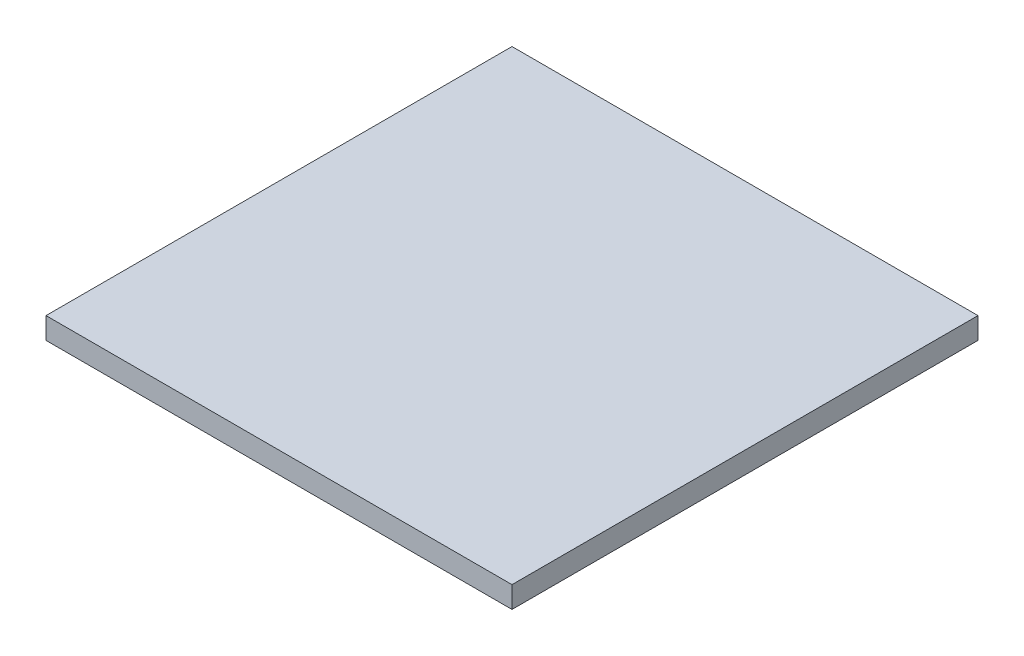
ISO-10303-21;
HEADER;
FILE_DESCRIPTION(('STEP AP214'),'2;1');
FILE_NAME('part.step','',(''),(''),'','','');
FILE_SCHEMA(('AUTOMOTIVE_DESIGN { 1 0 10303 214 1 1 1 1 }'));
ENDSEC;
DATA;
#1=APPLICATION_CONTEXT('core data for automotive mechanical design processes');
#2=APPLICATION_PROTOCOL_DEFINITION('international standard','automotive_design',2000,#1);
#3=PRODUCT_CONTEXT('',#1,'mechanical');
#4=PRODUCT('Part','Part','',(#3));
#5=PRODUCT_RELATED_PRODUCT_CATEGORY('part','',(#4));
#6=PRODUCT_DEFINITION_FORMATION('','',#4);
#7=PRODUCT_DEFINITION_CONTEXT('part definition',#1,'design');
#8=PRODUCT_DEFINITION('design','',#6,#7);
#9=PRODUCT_DEFINITION_SHAPE('','',#8);
#10=(LENGTH_UNIT() NAMED_UNIT(*) SI_UNIT(.MILLI.,.METRE.));
#11=(NAMED_UNIT(*) PLANE_ANGLE_UNIT() SI_UNIT($,.RADIAN.));
#12=(NAMED_UNIT(*) SI_UNIT($,.STERADIAN.) SOLID_ANGLE_UNIT());
#13=UNCERTAINTY_MEASURE_WITH_UNIT(LENGTH_MEASURE(1.E-05),#10,'distance_accuracy_value','');
#14=(GEOMETRIC_REPRESENTATION_CONTEXT(3) GLOBAL_UNCERTAINTY_ASSIGNED_CONTEXT((#13)) GLOBAL_UNIT_ASSIGNED_CONTEXT((#10,
#11,#12)) REPRESENTATION_CONTEXT('',''));
#15=CARTESIAN_POINT('',(0.,0.,0.));
#16=DIRECTION('',(0.,0.,1.));
#17=DIRECTION('',(1.,0.,0.));
#18=AXIS2_PLACEMENT_3D('',#15,#16,#17);
#19=CARTESIAN_POINT('',(-46.0849643347838,35.4384983767566,197.019416592901));
#20=DIRECTION('',(0.,1.,0.));
#21=DIRECTION('',(0.,0.,1.));
#22=AXIS2_PLACEMENT_3D('',#19,#20,#21);
#23=PLANE('',#22);
#24=DIRECTION('',(0.,0.,-1.));
#25=VECTOR('',#24,1.);
#26=CARTESIAN_POINT('',(-62.5949643347838,35.4384983767566,180.509416592901));
#27=LINE('',#26,#25);
#28=CARTESIAN_POINT('',(-62.5949643347838,35.4384983767566,213.529416592901));
#29=VERTEX_POINT('',#28);
#30=CARTESIAN_POINT('',(-62.5949643347838,35.4384983767566,180.509416592901));
#31=VERTEX_POINT('',#30);
#32=EDGE_CURVE('E20',#29,#31,#27,.T.);
#33=ORIENTED_EDGE('',*,*,#32,.T.);
#34=DIRECTION('',(1.,0.,0.));
#35=VECTOR('',#34,1.);
#36=CARTESIAN_POINT('',(-62.5949643347838,35.4384983767566,180.509416592901));
#37=LINE('',#36,#35);
#38=CARTESIAN_POINT('',(-29.5749643347837,35.4384983767566,180.509416592901));
#39=VERTEX_POINT('',#38);
#40=EDGE_CURVE('E87',#31,#39,#37,.T.);
#41=ORIENTED_EDGE('',*,*,#40,.T.);
#42=DIRECTION('',(0.,0.,1.));
#43=VECTOR('',#42,1.);
#44=CARTESIAN_POINT('',(-29.5749643347837,35.4384983767566,180.509416592901));
#45=LINE('',#44,#43);
#46=CARTESIAN_POINT('',(-29.5749643347837,35.4384983767566,213.529416592901));
#47=VERTEX_POINT('',#46);
#48=EDGE_CURVE('E56',#39,#47,#45,.T.);
#49=ORIENTED_EDGE('',*,*,#48,.T.);
#50=DIRECTION('',(-1.,0.,0.));
#51=VECTOR('',#50,1.);
#52=CARTESIAN_POINT('',(-62.5949643347838,35.4384983767566,213.529416592901));
#53=LINE('',#52,#51);
#54=EDGE_CURVE('E58',#47,#29,#53,.T.);
#55=ORIENTED_EDGE('',*,*,#54,.T.);
#56=EDGE_LOOP('',(#33,#41,#49,#55));
#57=FACE_BOUND('',#56,.T.);
#58=ADVANCED_FACE('F17',(#57),#23,.F.);
#59=CARTESIAN_POINT('',(-62.5949643347838,36.9624983767565,180.509416592901));
#60=DIRECTION('',(1.,0.,0.));
#61=DIRECTION('',(0.,0.,-1.));
#62=AXIS2_PLACEMENT_3D('',#59,#60,#61);
#63=PLANE('',#62);
#64=DIRECTION('',(0.,0.,1.));
#65=VECTOR('',#64,1.);
#66=CARTESIAN_POINT('',(-62.5949643347838,36.9624983767565,197.019416592901));
#67=LINE('',#66,#65);
#68=CARTESIAN_POINT('',(-62.5949643347838,36.9624983767565,180.509416592901));
#69=VERTEX_POINT('',#68);
#70=CARTESIAN_POINT('',(-62.5949643347838,36.9624983767565,213.529416592901));
#71=VERTEX_POINT('',#70);
#72=EDGE_CURVE('E94',#69,#71,#67,.T.);
#73=ORIENTED_EDGE('',*,*,#72,.F.);
#74=DIRECTION('',(0.,1.,0.));
#75=VECTOR('',#74,1.);
#76=CARTESIAN_POINT('',(-62.5949643347838,36.9624983767565,180.509416592901));
#77=LINE('',#76,#75);
#78=EDGE_CURVE('E70',#69,#31,#77,.F.);
#79=ORIENTED_EDGE('',*,*,#78,.T.);
#80=ORIENTED_EDGE('',*,*,#32,.F.);
#81=DIRECTION('',(0.,1.,0.));
#82=VECTOR('',#81,1.);
#83=CARTESIAN_POINT('',(-62.5949643347838,36.9624983767565,213.529416592901));
#84=LINE('',#83,#82);
#85=EDGE_CURVE('E65',#29,#71,#84,.T.);
#86=ORIENTED_EDGE('',*,*,#85,.T.);
#87=EDGE_LOOP('',(#73,#79,#80,#86));
#88=FACE_BOUND('',#87,.T.);
#89=ADVANCED_FACE('F67',(#88),#63,.F.);
#90=CARTESIAN_POINT('',(-62.5949643347838,36.9624983767565,213.529416592901));
#91=DIRECTION('',(0.,0.,-1.));
#92=DIRECTION('',(-1.,0.,0.));
#93=AXIS2_PLACEMENT_3D('',#90,#91,#92);
#94=PLANE('',#93);
#95=DIRECTION('',(1.,0.,0.));
#96=VECTOR('',#95,1.);
#97=CARTESIAN_POINT('',(-46.0849643347838,36.9624983767565,213.529416592901));
#98=LINE('',#97,#96);
#99=CARTESIAN_POINT('',(-29.5749643347837,36.9624983767565,213.529416592901));
#100=VERTEX_POINT('',#99);
#101=EDGE_CURVE('E75',#71,#100,#98,.T.);
#102=ORIENTED_EDGE('',*,*,#101,.F.);
#103=ORIENTED_EDGE('',*,*,#85,.F.);
#104=ORIENTED_EDGE('',*,*,#54,.F.);
#105=DIRECTION('',(0.,1.,0.));
#106=VECTOR('',#105,1.);
#107=CARTESIAN_POINT('',(-29.5749643347837,36.9624983767565,213.529416592901));
#108=LINE('',#107,#106);
#109=EDGE_CURVE('E82',#47,#100,#108,.T.);
#110=ORIENTED_EDGE('',*,*,#109,.T.);
#111=EDGE_LOOP('',(#102,#103,#104,#110));
#112=FACE_BOUND('',#111,.T.);
#113=ADVANCED_FACE('F73',(#112),#94,.F.);
#114=CARTESIAN_POINT('',(-29.5749643347837,36.9624983767565,180.509416592901));
#115=DIRECTION('',(-1.,0.,0.));
#116=DIRECTION('',(0.,0.,1.));
#117=AXIS2_PLACEMENT_3D('',#114,#115,#116);
#118=PLANE('',#117);
#119=DIRECTION('',(0.,0.,1.));
#120=VECTOR('',#119,1.);
#121=CARTESIAN_POINT('',(-29.5749643347837,36.9624983767565,197.019416592901));
#122=LINE('',#121,#120);
#123=CARTESIAN_POINT('',(-29.5749643347837,36.9624983767565,180.509416592901));
#124=VERTEX_POINT('',#123);
#125=EDGE_CURVE('E27',#100,#124,#122,.F.);
#126=ORIENTED_EDGE('',*,*,#125,.F.);
#127=ORIENTED_EDGE('',*,*,#109,.F.);
#128=ORIENTED_EDGE('',*,*,#48,.F.);
#129=DIRECTION('',(0.,1.,0.));
#130=VECTOR('',#129,1.);
#131=CARTESIAN_POINT('',(-29.5749643347837,36.9624983767565,180.509416592901));
#132=LINE('',#131,#130);
#133=EDGE_CURVE('E36',#39,#124,#132,.T.);
#134=ORIENTED_EDGE('',*,*,#133,.T.);
#135=EDGE_LOOP('',(#126,#127,#128,#134));
#136=FACE_BOUND('',#135,.T.);
#137=ADVANCED_FACE('F102',(#136),#118,.F.);
#138=CARTESIAN_POINT('',(-62.5949643347838,36.9624983767565,180.509416592901));
#139=DIRECTION('',(0.,0.,1.));
#140=DIRECTION('',(1.,0.,0.));
#141=AXIS2_PLACEMENT_3D('',#138,#139,#140);
#142=PLANE('',#141);
#143=DIRECTION('',(1.,0.,0.));
#144=VECTOR('',#143,1.);
#145=CARTESIAN_POINT('',(-46.0849643347838,36.9624983767565,180.509416592901));
#146=LINE('',#145,#144);
#147=EDGE_CURVE('E11',#124,#69,#146,.F.);
#148=ORIENTED_EDGE('',*,*,#147,.F.);
#149=ORIENTED_EDGE('',*,*,#133,.F.);
#150=ORIENTED_EDGE('',*,*,#40,.F.);
#151=ORIENTED_EDGE('',*,*,#78,.F.);
#152=EDGE_LOOP('',(#148,#149,#150,#151));
#153=FACE_BOUND('',#152,.T.);
#154=ADVANCED_FACE('F104',(#153),#142,.F.);
#155=CARTESIAN_POINT('',(-46.0849643347838,36.9624983767565,197.019416592901));
#156=DIRECTION('',(0.,1.,0.));
#157=DIRECTION('',(0.,0.,1.));
#158=AXIS2_PLACEMENT_3D('',#155,#156,#157);
#159=PLANE('',#158);
#160=ORIENTED_EDGE('',*,*,#125,.T.);
#161=ORIENTED_EDGE('',*,*,#147,.T.);
#162=ORIENTED_EDGE('',*,*,#72,.T.);
#163=ORIENTED_EDGE('',*,*,#101,.T.);
#164=EDGE_LOOP('',(#160,#161,#162,#163));
#165=FACE_BOUND('',#164,.T.);
#166=ADVANCED_FACE('F101',(#165),#159,.T.);
#167=CLOSED_SHELL('',(#58,#89,#113,#137,#154,#166));
#168=MANIFOLD_SOLID_BREP('B1',#167);
#169=ADVANCED_BREP_SHAPE_REPRESENTATION('',(#18,#168),#14);
#170=SHAPE_DEFINITION_REPRESENTATION(#9,#169);
ENDSEC;
END-ISO-10303-21;
